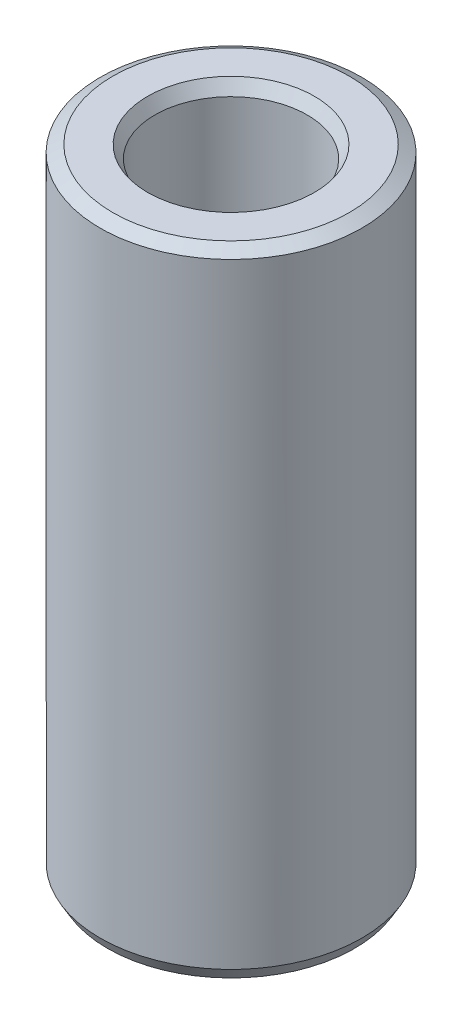
ISO-10303-21;
HEADER;
FILE_DESCRIPTION(('STEP AP214'),'2;1');
FILE_NAME('part.step','',(''),(''),'','','');
FILE_SCHEMA(('AUTOMOTIVE_DESIGN { 1 0 10303 214 1 1 1 1 }'));
ENDSEC;
DATA;
#1=APPLICATION_CONTEXT('core data for automotive mechanical design processes');
#2=APPLICATION_PROTOCOL_DEFINITION('international standard','automotive_design',2000,#1);
#3=PRODUCT_CONTEXT('',#1,'mechanical');
#4=PRODUCT('Part','Part','',(#3));
#5=PRODUCT_RELATED_PRODUCT_CATEGORY('part','',(#4));
#6=PRODUCT_DEFINITION_FORMATION('','',#4);
#7=PRODUCT_DEFINITION_CONTEXT('part definition',#1,'design');
#8=PRODUCT_DEFINITION('design','',#6,#7);
#9=PRODUCT_DEFINITION_SHAPE('','',#8);
#10=(LENGTH_UNIT() NAMED_UNIT(*) SI_UNIT(.MILLI.,.METRE.));
#11=(NAMED_UNIT(*) PLANE_ANGLE_UNIT() SI_UNIT($,.RADIAN.));
#12=(NAMED_UNIT(*) SI_UNIT($,.STERADIAN.) SOLID_ANGLE_UNIT());
#13=UNCERTAINTY_MEASURE_WITH_UNIT(LENGTH_MEASURE(1.E-05),#10,'distance_accuracy_value','');
#14=(GEOMETRIC_REPRESENTATION_CONTEXT(3) GLOBAL_UNCERTAINTY_ASSIGNED_CONTEXT((#13)) GLOBAL_UNIT_ASSIGNED_CONTEXT((#10,
#11,#12)) REPRESENTATION_CONTEXT('',''));
#15=CARTESIAN_POINT('',(0.,0.,0.));
#16=DIRECTION('',(0.,0.,1.));
#17=DIRECTION('',(1.,0.,0.));
#18=AXIS2_PLACEMENT_3D('',#15,#16,#17);
#19=CARTESIAN_POINT('',(0.,266.87733834506,0.));
#20=DIRECTION('',(0.,-1.,0.));
#21=DIRECTION('',(0.,0.,-1.));
#22=AXIS2_PLACEMENT_3D('',#19,#20,#21);
#23=CYLINDRICAL_SURFACE('',#22,55.);
#24=CARTESIAN_POINT('',(0.,5.272696299159,0.));
#25=DIRECTION('',(0.,1.,0.));
#26=DIRECTION('',(0.,0.,1.));
#27=AXIS2_PLACEMENT_3D('',#24,#25,#26);
#28=CIRCLE('',#27,55.);
#29=CARTESIAN_POINT('',(0.,5.272696299159,55.));
#30=VERTEX_POINT('',#29);
#31=EDGE_CURVE('E10',#30,#30,#28,.T.);
#32=ORIENTED_EDGE('',*,*,#31,.T.);
#33=EDGE_LOOP('',(#32));
#34=FACE_BOUND('',#33,.T.);
#35=CARTESIAN_POINT('',(0.,263.833145717386,0.));
#36=DIRECTION('',(0.,1.,0.));
#37=DIRECTION('',(0.,0.,1.));
#38=AXIS2_PLACEMENT_3D('',#35,#36,#37);
#39=CIRCLE('',#38,55.);
#40=CARTESIAN_POINT('',(0.,263.833145717386,-55.));
#41=VERTEX_POINT('',#40);
#42=EDGE_CURVE('E50',#41,#41,#39,.F.);
#43=ORIENTED_EDGE('',*,*,#42,.T.);
#44=EDGE_LOOP('',(#43));
#45=FACE_BOUND('',#44,.T.);
#46=ADVANCED_FACE('F39',(#34,#45),#23,.T.);
#47=CARTESIAN_POINT('',(0.,266.87733834506,0.));
#48=DIRECTION('',(0.,1.,0.));
#49=DIRECTION('',(0.,0.,1.));
#50=AXIS2_PLACEMENT_3D('',#47,#48,#49);
#51=PLANE('',#50);
#52=CARTESIAN_POINT('',(0.,266.87733834506,0.));
#53=DIRECTION('',(0.,1.,0.));
#54=DIRECTION('',(0.,0.,1.));
#55=AXIS2_PLACEMENT_3D('',#52,#53,#54);
#56=CIRCLE('',#55,35.0745689451667);
#57=CARTESIAN_POINT('',(0.,266.87733834506,35.0745689451667));
#58=VERTEX_POINT('',#57);
#59=EDGE_CURVE('E58',#58,#58,#56,.F.);
#60=ORIENTED_EDGE('',*,*,#59,.T.);
#61=EDGE_LOOP('',(#60));
#62=FACE_BOUND('',#61,.T.);
#63=CARTESIAN_POINT('',(0.,266.87733834506,0.));
#64=DIRECTION('',(0.,1.,0.));
#65=DIRECTION('',(0.,0.,1.));
#66=AXIS2_PLACEMENT_3D('',#63,#64,#65);
#67=CIRCLE('',#66,49.7273037008409);
#68=CARTESIAN_POINT('',(0.,266.87733834506,-49.7273037008409));
#69=VERTEX_POINT('',#68);
#70=EDGE_CURVE('E61',#69,#69,#67,.T.);
#71=ORIENTED_EDGE('',*,*,#70,.T.);
#72=EDGE_LOOP('',(#71));
#73=FACE_BOUND('',#72,.T.);
#74=ADVANCED_FACE('F88',(#62,#73),#51,.T.);
#75=CARTESIAN_POINT('',(0.,0.,0.));
#76=DIRECTION('',(0.,1.,0.));
#77=DIRECTION('',(0.,0.,1.));
#78=AXIS2_PLACEMENT_3D('',#75,#76,#77);
#79=PLANE('',#78);
#80=CARTESIAN_POINT('',(0.,0.,0.));
#81=DIRECTION('',(0.,1.,0.));
#82=DIRECTION('',(0.,0.,1.));
#83=AXIS2_PLACEMENT_3D('',#80,#81,#82);
#84=CIRCLE('',#83,37.303072616651);
#85=CARTESIAN_POINT('',(0.,0.,37.303072616651));
#86=VERTEX_POINT('',#85);
#87=EDGE_CURVE('E51',#86,#86,#84,.T.);
#88=ORIENTED_EDGE('',*,*,#87,.T.);
#89=EDGE_LOOP('',(#88));
#90=FACE_BOUND('',#89,.T.);
#91=CARTESIAN_POINT('',(0.,0.,0.));
#92=DIRECTION('',(0.,1.,0.));
#93=DIRECTION('',(0.,0.,1.));
#94=AXIS2_PLACEMENT_3D('',#91,#92,#93);
#95=CIRCLE('',#94,51.9558073723254);
#96=CARTESIAN_POINT('',(0.,0.,51.9558073723254));
#97=VERTEX_POINT('',#96);
#98=EDGE_CURVE('E54',#97,#97,#95,.F.);
#99=ORIENTED_EDGE('',*,*,#98,.T.);
#100=EDGE_LOOP('',(#99));
#101=FACE_BOUND('',#100,.T.);
#102=ADVANCED_FACE('F83',(#90,#101),#79,.F.);
#103=CARTESIAN_POINT('',(0.,266.87733834506,0.));
#104=DIRECTION('',(0.,-1.,0.));
#105=DIRECTION('',(0.,0.,-1.));
#106=AXIS2_PLACEMENT_3D('',#103,#104,#105);
#107=CYLINDRICAL_SURFACE('',#106,32.0303763174919);
#108=CARTESIAN_POINT('',(0.,261.604642045901,0.));
#109=DIRECTION('',(0.,1.,0.));
#110=DIRECTION('',(0.,0.,1.));
#111=AXIS2_PLACEMENT_3D('',#108,#109,#110);
#112=CIRCLE('',#111,32.0303763174919);
#113=CARTESIAN_POINT('',(0.,261.604642045901,32.0303763174919));
#114=VERTEX_POINT('',#113);
#115=EDGE_CURVE('E67',#114,#114,#112,.T.);
#116=ORIENTED_EDGE('',*,*,#115,.T.);
#117=EDGE_LOOP('',(#116));
#118=FACE_BOUND('',#117,.T.);
#119=CARTESIAN_POINT('',(0.,3.04419262767475,0.));
#120=DIRECTION('',(0.,1.,0.));
#121=DIRECTION('',(0.,0.,1.));
#122=AXIS2_PLACEMENT_3D('',#119,#120,#121);
#123=CIRCLE('',#122,32.0303763174919);
#124=CARTESIAN_POINT('',(0.,3.04419262767475,32.0303763174919));
#125=VERTEX_POINT('',#124);
#126=EDGE_CURVE('E69',#125,#125,#123,.F.);
#127=ORIENTED_EDGE('',*,*,#126,.T.);
#128=EDGE_LOOP('',(#127));
#129=FACE_BOUND('',#128,.T.);
#130=ADVANCED_FACE('F71',(#118,#129),#107,.F.);
#131=CARTESIAN_POINT('',(0.,261.604642045901,0.));
#132=DIRECTION('',(0.,1.,0.));
#133=DIRECTION('',(0.,0.,1.));
#134=AXIS2_PLACEMENT_3D('',#131,#132,#133);
#135=CONICAL_SURFACE('',#134,32.0303763174919,0.5235987755983);
#136=ORIENTED_EDGE('',*,*,#59,.F.);
#137=EDGE_LOOP('',(#136));
#138=FACE_BOUND('',#137,.T.);
#139=ORIENTED_EDGE('',*,*,#115,.F.);
#140=EDGE_LOOP('',(#139));
#141=FACE_BOUND('',#140,.T.);
#142=ADVANCED_FACE('F77',(#138,#141),#135,.F.);
#143=CARTESIAN_POINT('',(0.,0.,0.));
#144=DIRECTION('',(0.,-1.,0.));
#145=DIRECTION('',(0.,0.,-1.));
#146=AXIS2_PLACEMENT_3D('',#143,#144,#145);
#147=CONICAL_SURFACE('',#146,37.303072616651,1.04719755119659);
#148=ORIENTED_EDGE('',*,*,#126,.F.);
#149=EDGE_LOOP('',(#148));
#150=FACE_BOUND('',#149,.T.);
#151=ORIENTED_EDGE('',*,*,#87,.F.);
#152=EDGE_LOOP('',(#151));
#153=FACE_BOUND('',#152,.T.);
#154=ADVANCED_FACE('F73',(#150,#153),#147,.F.);
#155=CARTESIAN_POINT('',(0.,5.272696299159,0.));
#156=DIRECTION('',(0.,1.,0.));
#157=DIRECTION('',(0.,0.,1.));
#158=AXIS2_PLACEMENT_3D('',#155,#156,#157);
#159=CONICAL_SURFACE('',#158,55.,0.523598775598298);
#160=ORIENTED_EDGE('',*,*,#98,.F.);
#161=EDGE_LOOP('',(#160));
#162=FACE_BOUND('',#161,.T.);
#163=ORIENTED_EDGE('',*,*,#31,.F.);
#164=EDGE_LOOP('',(#163));
#165=FACE_BOUND('',#164,.T.);
#166=ADVANCED_FACE('F76',(#162,#165),#159,.T.);
#167=CARTESIAN_POINT('',(0.,266.87733834506,0.));
#168=DIRECTION('',(0.,-1.,0.));
#169=DIRECTION('',(0.,0.,-1.));
#170=AXIS2_PLACEMENT_3D('',#167,#168,#169);
#171=CONICAL_SURFACE('',#170,49.7273037008409,1.04719755119659);
#172=CARTESIAN_POINT('',(0.,263.833145717386,-55.));
#173=CARTESIAN_POINT('',(0.,263.864856057257,-54.9450760802171));
#174=CARTESIAN_POINT('',(0.,263.896566397129,-54.8901521604342));
#175=CARTESIAN_POINT('',(0.,263.959987076872,-54.7803043208684));
#176=CARTESIAN_POINT('',(0.,263.991697416744,-54.7253804010855));
#177=CARTESIAN_POINT('',(0.,264.055118096487,-54.6155325615197));
#178=CARTESIAN_POINT('',(0.,264.086828436358,-54.5606086417368));
#179=CARTESIAN_POINT('',(0.,264.150249116102,-54.450760802171));
#180=CARTESIAN_POINT('',(0.,264.181959455973,-54.3958368823881));
#181=CARTESIAN_POINT('',(0.,264.245380135716,-54.2859890428223));
#182=CARTESIAN_POINT('',(0.,264.277090475588,-54.2310651230393));
#183=CARTESIAN_POINT('',(0.,264.340511155331,-54.1212172834735));
#184=CARTESIAN_POINT('',(0.,264.372221495203,-54.0662933636906));
#185=CARTESIAN_POINT('',(0.,264.435642174946,-53.9564455241248));
#186=CARTESIAN_POINT('',(0.,264.467352514818,-53.9015216043419));
#187=CARTESIAN_POINT('',(0.,264.530773194561,-53.7916737647761));
#188=CARTESIAN_POINT('',(0.,264.562483534433,-53.7367498449932));
#189=CARTESIAN_POINT('',(0.,264.625904214176,-53.6269020054274));
#190=CARTESIAN_POINT('',(0.,264.657614554047,-53.5719780856445));
#191=CARTESIAN_POINT('',(0.,264.721035233791,-53.4621302460786));
#192=CARTESIAN_POINT('',(0.,264.752745573662,-53.4072063262957));
#193=CARTESIAN_POINT('',(0.,264.816166253405,-53.2973584867299));
#194=CARTESIAN_POINT('',(0.,264.847876593277,-53.242434566947));
#195=CARTESIAN_POINT('',(0.,264.91129727302,-53.1325867273812));
#196=CARTESIAN_POINT('',(0.,264.943007612892,-53.0776628075983));
#197=CARTESIAN_POINT('',(0.,265.006428292635,-52.9678149680325));
#198=CARTESIAN_POINT('',(0.,265.038138632507,-52.9128910482496));
#199=CARTESIAN_POINT('',(0.,265.10155931225,-52.8030432086838));
#200=CARTESIAN_POINT('',(0.,265.133269652122,-52.7481192889009));
#201=CARTESIAN_POINT('',(0.,265.196690331865,-52.638271449335));
#202=CARTESIAN_POINT('',(0.,265.228400671736,-52.5833475295521));
#203=CARTESIAN_POINT('',(0.,265.29182135148,-52.4734996899863));
#204=CARTESIAN_POINT('',(0.,265.323531691351,-52.4185757702034));
#205=CARTESIAN_POINT('',(0.,265.386952371094,-52.3087279306376));
#206=CARTESIAN_POINT('',(0.,265.418662710966,-52.2538040108547));
#207=CARTESIAN_POINT('',(0.,265.482083390709,-52.1439561712889));
#208=CARTESIAN_POINT('',(0.,265.513793730581,-52.089032251506));
#209=CARTESIAN_POINT('',(0.,265.577214410324,-51.9791844119401));
#210=CARTESIAN_POINT('',(0.,265.608924750196,-51.9242604921572));
#211=CARTESIAN_POINT('',(0.,265.672345429939,-51.8144126525914));
#212=CARTESIAN_POINT('',(0.,265.704055769811,-51.7594887328085));
#213=CARTESIAN_POINT('',(0.,265.767476449554,-51.6496408932427));
#214=CARTESIAN_POINT('',(0.,265.799186789426,-51.5947169734598));
#215=CARTESIAN_POINT('',(0.,265.862607469169,-51.484869133894));
#216=CARTESIAN_POINT('',(0.,265.89431780904,-51.4299452141111));
#217=CARTESIAN_POINT('',(0.,265.957738488783,-51.3200973745453));
#218=CARTESIAN_POINT('',(0.,265.989448828655,-51.2651734547623));
#219=CARTESIAN_POINT('',(0.,266.052869508398,-51.1553256151965));
#220=CARTESIAN_POINT('',(0.,266.08457984827,-51.1004016954136));
#221=CARTESIAN_POINT('',(0.,266.148000528013,-50.9905538558478));
#222=CARTESIAN_POINT('',(0.,266.179710867885,-50.9356299360649));
#223=CARTESIAN_POINT('',(0.,266.243131547628,-50.8257820964991));
#224=CARTESIAN_POINT('',(0.,266.2748418875,-50.7708581767162));
#225=CARTESIAN_POINT('',(0.,266.338262567243,-50.6610103371504));
#226=CARTESIAN_POINT('',(0.,266.369972907115,-50.6060864173675));
#227=CARTESIAN_POINT('',(0.,266.433393586858,-50.4962385778016));
#228=CARTESIAN_POINT('',(0.,266.465103926729,-50.4413146580187));
#229=CARTESIAN_POINT('',(0.,266.528524606473,-50.3314668184529));
#230=CARTESIAN_POINT('',(0.,266.560234946344,-50.27654289867));
#231=CARTESIAN_POINT('',(0.,266.623655626087,-50.1666950591042));
#232=CARTESIAN_POINT('',(0.,266.655365965959,-50.1117711393213));
#233=CARTESIAN_POINT('',(0.,266.718786645702,-50.0019232997555));
#234=CARTESIAN_POINT('',(0.,266.750496985574,-49.9469993799726));
#235=CARTESIAN_POINT('',(0.,266.813917665317,-49.8371515404068));
#236=CARTESIAN_POINT('',(0.,266.845628005189,-49.7822276206238));
#237=CARTESIAN_POINT('',(0.,266.87733834506,-49.7273037008409));
#238=B_SPLINE_CURVE_WITH_KNOTS('',3,(#172,#173,#174,#175,#176,#177,#178,#179,#180,#181,#182,
#183,#184,#185,#186,#187,#188,#189,#190,#191,#192,#193,#194,#195,#196,#197,#198,#199,#200,#201,
#202,#203,#204,#205,#206,#207,#208,#209,#210,#211,#212,#213,#214,#215,#216,#217,#218,#219,#220,
#221,#222,#223,#224,#225,#226,#227,#228,#229,#230,#231,#232,#233,#234,#235,#236,#237),
.UNSPECIFIED.,.F.,.F.,(4,2,2,2,2,2,2,2,2,2,2,2,2,2,2,2,2,2,2,2,2,2,2,2,2,2,2,2,2,2,2,2,4),(0.,
0.190262039229669,0.380524078459332,0.570786117689,0.761048156918669,0.951310196148338,
1.141572235378,1.33183427460767,1.52209631383734,1.71235835306701,1.90262039229667,
2.09288243152634,2.28314447075601,2.47340650998568,2.66366854921534,2.85393058844501,
3.04419262767468,3.23445466690435,3.42471670613401,3.61497874536368,3.80524078459335,
3.99550282382302,4.18576486305268,4.37602690228235,4.56628894151202,4.75655098074169,
4.94681301997136,5.13707505920102,5.32733709843069,5.51759913766036,5.70786117689003,
5.89812321611969,6.08838525534936),.UNSPECIFIED.);
#239=EDGE_CURVE('BSEAM45',#41,#69,#238,.T.);
#240=ORIENTED_EDGE('',*,*,#42,.F.);
#241=ORIENTED_EDGE('',*,*,#70,.F.);
#242=ORIENTED_EDGE('',*,*,#239,.T.);
#243=ORIENTED_EDGE('',*,*,#239,.F.);
#244=EDGE_LOOP('',(#240,#242,#241,#243));
#245=FACE_BOUND('',#244,.T.);
#246=ADVANCED_FACE('F45',(#245),#171,.T.);
#247=CLOSED_SHELL('',(#46,#74,#102,#130,#142,#154,#166,#246));
#248=MANIFOLD_SOLID_BREP('B2',#247);
#249=ADVANCED_BREP_SHAPE_REPRESENTATION('',(#18,#248),#14);
#250=SHAPE_DEFINITION_REPRESENTATION(#9,#249);
ENDSEC;
END-ISO-10303-21;
